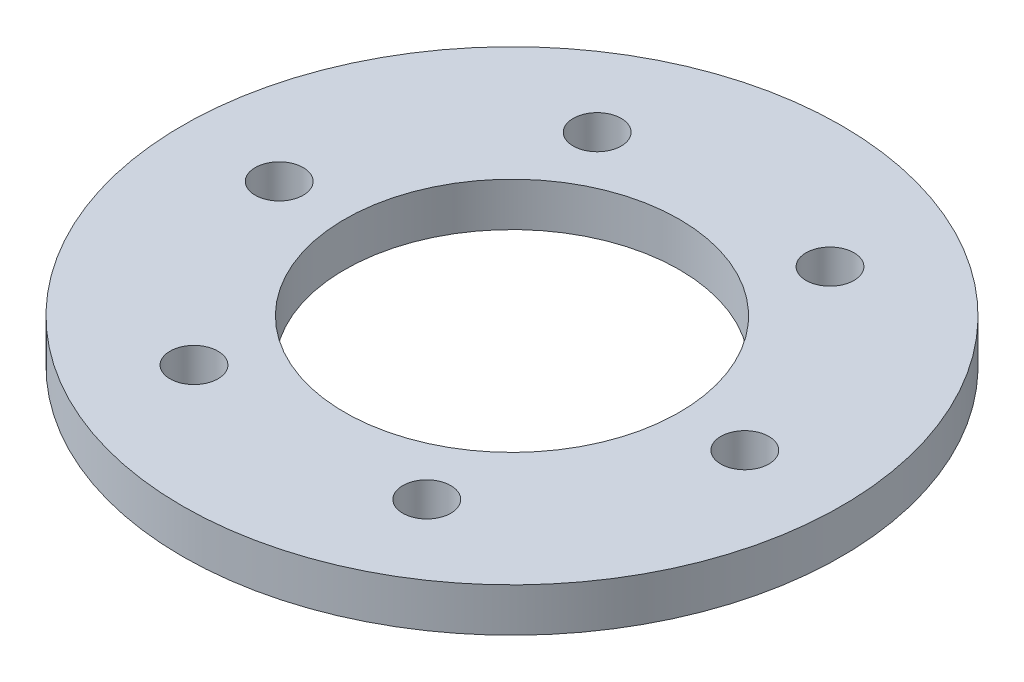
ISO-10303-21;
HEADER;
FILE_DESCRIPTION(('STEP AP214'),'2;1');
FILE_NAME('part.step','',(''),(''),'','','');
FILE_SCHEMA(('AUTOMOTIVE_DESIGN { 1 0 10303 214 1 1 1 1 }'));
ENDSEC;
DATA;
#1=APPLICATION_CONTEXT('core data for automotive mechanical design processes');
#2=APPLICATION_PROTOCOL_DEFINITION('international standard','automotive_design',2000,#1);
#3=PRODUCT_CONTEXT('',#1,'mechanical');
#4=PRODUCT('Part','Part','',(#3));
#5=PRODUCT_RELATED_PRODUCT_CATEGORY('part','',(#4));
#6=PRODUCT_DEFINITION_FORMATION('','',#4);
#7=PRODUCT_DEFINITION_CONTEXT('part definition',#1,'design');
#8=PRODUCT_DEFINITION('design','',#6,#7);
#9=PRODUCT_DEFINITION_SHAPE('','',#8);
#10=(LENGTH_UNIT() NAMED_UNIT(*) SI_UNIT(.MILLI.,.METRE.));
#11=(NAMED_UNIT(*) PLANE_ANGLE_UNIT() SI_UNIT($,.RADIAN.));
#12=(NAMED_UNIT(*) SI_UNIT($,.STERADIAN.) SOLID_ANGLE_UNIT());
#13=UNCERTAINTY_MEASURE_WITH_UNIT(LENGTH_MEASURE(1.E-05),#10,'distance_accuracy_value','');
#14=(GEOMETRIC_REPRESENTATION_CONTEXT(3) GLOBAL_UNCERTAINTY_ASSIGNED_CONTEXT((#13)) GLOBAL_UNIT_ASSIGNED_CONTEXT((#10,
#11,#12)) REPRESENTATION_CONTEXT('',''));
#15=CARTESIAN_POINT('',(0.,0.,0.));
#16=DIRECTION('',(0.,0.,1.));
#17=DIRECTION('',(1.,0.,0.));
#18=AXIS2_PLACEMENT_3D('',#15,#16,#17);
#19=CARTESIAN_POINT('',(-285.501924726853,0.,12.7228753496177));
#20=DIRECTION('',(0.,-1.,0.));
#21=DIRECTION('',(0.,0.,-1.));
#22=AXIS2_PLACEMENT_3D('',#19,#20,#21);
#23=PLANE('',#22);
#24=CARTESIAN_POINT('',(-285.501924726853,0.,12.7228753496177));
#25=DIRECTION('',(0.,-1.,0.));
#26=DIRECTION('',(0.,0.,-1.));
#27=AXIS2_PLACEMENT_3D('',#24,#25,#26);
#28=CIRCLE('',#27,22.65);
#29=CARTESIAN_POINT('',(-285.501924726853,0.,-9.9271246503823));
#30=VERTEX_POINT('',#29);
#31=EDGE_CURVE('E12',#30,#30,#28,.T.);
#32=ORIENTED_EDGE('',*,*,#31,.F.);
#33=EDGE_LOOP('',(#32));
#34=FACE_BOUND('',#33,.T.);
#35=CARTESIAN_POINT('',(-277.501924726853,0.,26.5792818101687));
#36=DIRECTION('',(0.,-1.,0.));
#37=DIRECTION('',(0.,0.,-1.));
#38=AXIS2_PLACEMENT_3D('',#35,#36,#37);
#39=CIRCLE('',#38,1.65);
#40=CARTESIAN_POINT('',(-277.501924726853,0.,24.9292818101687));
#41=VERTEX_POINT('',#40);
#42=EDGE_CURVE('E137',#41,#41,#39,.T.);
#43=ORIENTED_EDGE('',*,*,#42,.T.);
#44=EDGE_LOOP('',(#43));
#45=FACE_BOUND('',#44,.T.);
#46=CARTESIAN_POINT('',(-269.501924726853,0.,12.7228753496177));
#47=DIRECTION('',(0.,-1.,0.));
#48=DIRECTION('',(0.,0.,-1.));
#49=AXIS2_PLACEMENT_3D('',#46,#47,#48);
#50=CIRCLE('',#49,1.65);
#51=CARTESIAN_POINT('',(-269.501924726853,0.,11.0728753496177));
#52=VERTEX_POINT('',#51);
#53=EDGE_CURVE('E108',#52,#52,#50,.T.);
#54=ORIENTED_EDGE('',*,*,#53,.T.);
#55=EDGE_LOOP('',(#54));
#56=FACE_BOUND('',#55,.T.);
#57=CARTESIAN_POINT('',(-277.501924726853,0.,-1.13353111093332));
#58=DIRECTION('',(0.,-1.,0.));
#59=DIRECTION('',(0.,0.,-1.));
#60=AXIS2_PLACEMENT_3D('',#57,#58,#59);
#61=CIRCLE('',#60,1.65);
#62=CARTESIAN_POINT('',(-277.501924726853,0.,-2.78353111093332));
#63=VERTEX_POINT('',#62);
#64=EDGE_CURVE('E23',#63,#63,#61,.T.);
#65=ORIENTED_EDGE('',*,*,#64,.T.);
#66=EDGE_LOOP('',(#65));
#67=FACE_BOUND('',#66,.T.);
#68=CARTESIAN_POINT('',(-293.501924726853,0.,-1.13353111093334));
#69=DIRECTION('',(0.,-1.,0.));
#70=DIRECTION('',(0.,0.,-1.));
#71=AXIS2_PLACEMENT_3D('',#68,#69,#70);
#72=CIRCLE('',#71,1.65);
#73=CARTESIAN_POINT('',(-293.501924726853,0.,-2.78353111093334));
#74=VERTEX_POINT('',#73);
#75=EDGE_CURVE('E133',#74,#74,#72,.T.);
#76=ORIENTED_EDGE('',*,*,#75,.T.);
#77=EDGE_LOOP('',(#76));
#78=FACE_BOUND('',#77,.T.);
#79=CARTESIAN_POINT('',(-301.501924726853,0.,12.7228753496177));
#80=DIRECTION('',(0.,-1.,0.));
#81=DIRECTION('',(0.,0.,-1.));
#82=AXIS2_PLACEMENT_3D('',#79,#80,#81);
#83=CIRCLE('',#82,1.65);
#84=CARTESIAN_POINT('',(-301.501924726853,0.,11.0728753496177));
#85=VERTEX_POINT('',#84);
#86=EDGE_CURVE('E151',#85,#85,#83,.T.);
#87=ORIENTED_EDGE('',*,*,#86,.T.);
#88=EDGE_LOOP('',(#87));
#89=FACE_BOUND('',#88,.T.);
#90=CARTESIAN_POINT('',(-293.501924726853,0.,26.5792818101687));
#91=DIRECTION('',(0.,-1.,0.));
#92=DIRECTION('',(0.,0.,-1.));
#93=AXIS2_PLACEMENT_3D('',#90,#91,#92);
#94=CIRCLE('',#93,1.65);
#95=CARTESIAN_POINT('',(-293.501924726853,0.,24.9292818101687));
#96=VERTEX_POINT('',#95);
#97=EDGE_CURVE('E161',#96,#96,#94,.T.);
#98=ORIENTED_EDGE('',*,*,#97,.T.);
#99=EDGE_LOOP('',(#98));
#100=FACE_BOUND('',#99,.T.);
#101=CARTESIAN_POINT('',(-285.501924726853,0.,12.7228753496177));
#102=DIRECTION('',(0.,-1.,0.));
#103=DIRECTION('',(0.,0.,-1.));
#104=AXIS2_PLACEMENT_3D('',#101,#102,#103);
#105=CIRCLE('',#104,11.5);
#106=CARTESIAN_POINT('',(-285.501924726853,0.,1.2228753496177));
#107=VERTEX_POINT('',#106);
#108=EDGE_CURVE('E148',#107,#107,#105,.T.);
#109=ORIENTED_EDGE('',*,*,#108,.T.);
#110=EDGE_LOOP('',(#109));
#111=FACE_BOUND('',#110,.T.);
#112=ADVANCED_FACE('F19',(#34,#45,#56,#67,#78,#89,#100,#111),#23,.F.);
#113=CARTESIAN_POINT('',(-285.501924726853,-3.,12.7228753496177));
#114=DIRECTION('',(0.,-1.,0.));
#115=DIRECTION('',(0.,0.,-1.));
#116=AXIS2_PLACEMENT_3D('',#113,#114,#115);
#117=PLANE('',#116);
#118=CARTESIAN_POINT('',(-285.501924726853,-3.,12.7228753496177));
#119=DIRECTION('',(0.,-1.,0.));
#120=DIRECTION('',(0.,0.,-1.));
#121=AXIS2_PLACEMENT_3D('',#118,#119,#120);
#122=CIRCLE('',#121,22.65);
#123=CARTESIAN_POINT('',(-285.501924726853,-3.,-9.9271246503823));
#124=VERTEX_POINT('',#123);
#125=EDGE_CURVE('E31',#124,#124,#122,.T.);
#126=ORIENTED_EDGE('',*,*,#125,.T.);
#127=EDGE_LOOP('',(#126));
#128=FACE_BOUND('',#127,.T.);
#129=CARTESIAN_POINT('',(-277.501924726853,-3.,26.5792818101687));
#130=DIRECTION('',(0.,-1.,0.));
#131=DIRECTION('',(0.,0.,-1.));
#132=AXIS2_PLACEMENT_3D('',#129,#130,#131);
#133=CIRCLE('',#132,1.65);
#134=CARTESIAN_POINT('',(-277.501924726853,-3.,24.9292818101687));
#135=VERTEX_POINT('',#134);
#136=EDGE_CURVE('E140',#135,#135,#133,.T.);
#137=ORIENTED_EDGE('',*,*,#136,.F.);
#138=EDGE_LOOP('',(#137));
#139=FACE_BOUND('',#138,.T.);
#140=CARTESIAN_POINT('',(-269.501924726853,-3.,12.7228753496177));
#141=DIRECTION('',(0.,-1.,0.));
#142=DIRECTION('',(0.,0.,-1.));
#143=AXIS2_PLACEMENT_3D('',#140,#141,#142);
#144=CIRCLE('',#143,1.65);
#145=CARTESIAN_POINT('',(-269.501924726853,-3.,11.0728753496177));
#146=VERTEX_POINT('',#145);
#147=EDGE_CURVE('E116',#146,#146,#144,.T.);
#148=ORIENTED_EDGE('',*,*,#147,.F.);
#149=EDGE_LOOP('',(#148));
#150=FACE_BOUND('',#149,.T.);
#151=CARTESIAN_POINT('',(-277.501924726853,-3.,-1.13353111093332));
#152=DIRECTION('',(0.,-1.,0.));
#153=DIRECTION('',(0.,0.,-1.));
#154=AXIS2_PLACEMENT_3D('',#151,#152,#153);
#155=CIRCLE('',#154,1.65);
#156=CARTESIAN_POINT('',(-277.501924726853,-3.,-2.78353111093332));
#157=VERTEX_POINT('',#156);
#158=EDGE_CURVE('E104',#157,#157,#155,.T.);
#159=ORIENTED_EDGE('',*,*,#158,.F.);
#160=EDGE_LOOP('',(#159));
#161=FACE_BOUND('',#160,.T.);
#162=CARTESIAN_POINT('',(-293.501924726853,-3.,-1.13353111093334));
#163=DIRECTION('',(0.,-1.,0.));
#164=DIRECTION('',(0.,0.,-1.));
#165=AXIS2_PLACEMENT_3D('',#162,#163,#164);
#166=CIRCLE('',#165,1.65);
#167=CARTESIAN_POINT('',(-293.501924726853,-3.,-2.78353111093334));
#168=VERTEX_POINT('',#167);
#169=EDGE_CURVE('E114',#168,#168,#166,.T.);
#170=ORIENTED_EDGE('',*,*,#169,.F.);
#171=EDGE_LOOP('',(#170));
#172=FACE_BOUND('',#171,.T.);
#173=CARTESIAN_POINT('',(-301.501924726853,-3.,12.7228753496177));
#174=DIRECTION('',(0.,-1.,0.));
#175=DIRECTION('',(0.,0.,-1.));
#176=AXIS2_PLACEMENT_3D('',#173,#174,#175);
#177=CIRCLE('',#176,1.65);
#178=CARTESIAN_POINT('',(-301.501924726853,-3.,11.0728753496177));
#179=VERTEX_POINT('',#178);
#180=EDGE_CURVE('E122',#179,#179,#177,.T.);
#181=ORIENTED_EDGE('',*,*,#180,.F.);
#182=EDGE_LOOP('',(#181));
#183=FACE_BOUND('',#182,.T.);
#184=CARTESIAN_POINT('',(-293.501924726853,-3.,26.5792818101687));
#185=DIRECTION('',(0.,-1.,0.));
#186=DIRECTION('',(0.,0.,-1.));
#187=AXIS2_PLACEMENT_3D('',#184,#185,#186);
#188=CIRCLE('',#187,1.65);
#189=CARTESIAN_POINT('',(-293.501924726853,-3.,24.9292818101687));
#190=VERTEX_POINT('',#189);
#191=EDGE_CURVE('E154',#190,#190,#188,.T.);
#192=ORIENTED_EDGE('',*,*,#191,.F.);
#193=EDGE_LOOP('',(#192));
#194=FACE_BOUND('',#193,.T.);
#195=CARTESIAN_POINT('',(-285.501924726853,-3.,12.7228753496177));
#196=DIRECTION('',(0.,-1.,0.));
#197=DIRECTION('',(0.,0.,-1.));
#198=AXIS2_PLACEMENT_3D('',#195,#196,#197);
#199=CIRCLE('',#198,11.5);
#200=CARTESIAN_POINT('',(-285.501924726853,-3.,1.2228753496177));
#201=VERTEX_POINT('',#200);
#202=EDGE_CURVE('E134',#201,#201,#199,.T.);
#203=ORIENTED_EDGE('',*,*,#202,.F.);
#204=EDGE_LOOP('',(#203));
#205=FACE_BOUND('',#204,.T.);
#206=ADVANCED_FACE('F181',(#128,#139,#150,#161,#172,#183,#194,#205),#117,.T.);
#207=CARTESIAN_POINT('',(-285.501924726853,-3.,12.7228753496177));
#208=DIRECTION('',(0.,1.,0.));
#209=DIRECTION('',(0.,0.,1.));
#210=AXIS2_PLACEMENT_3D('',#207,#208,#209);
#211=CYLINDRICAL_SURFACE('',#210,22.65);
#212=ORIENTED_EDGE('',*,*,#31,.T.);
#213=EDGE_LOOP('',(#212));
#214=FACE_BOUND('',#213,.T.);
#215=ORIENTED_EDGE('',*,*,#125,.F.);
#216=EDGE_LOOP('',(#215));
#217=FACE_BOUND('',#216,.T.);
#218=ADVANCED_FACE('F184',(#214,#217),#211,.T.);
#219=CARTESIAN_POINT('',(-285.501924726853,-3.,12.7228753496177));
#220=DIRECTION('',(0.,1.,0.));
#221=DIRECTION('',(0.,0.,1.));
#222=AXIS2_PLACEMENT_3D('',#219,#220,#221);
#223=CYLINDRICAL_SURFACE('',#222,11.5);
#224=ORIENTED_EDGE('',*,*,#108,.F.);
#225=EDGE_LOOP('',(#224));
#226=FACE_BOUND('',#225,.T.);
#227=ORIENTED_EDGE('',*,*,#202,.T.);
#228=EDGE_LOOP('',(#227));
#229=FACE_BOUND('',#228,.T.);
#230=ADVANCED_FACE('F198',(#226,#229),#223,.F.);
#231=CARTESIAN_POINT('',(-293.501924726853,-3.,26.5792818101687));
#232=DIRECTION('',(0.,1.,0.));
#233=DIRECTION('',(0.,0.,1.));
#234=AXIS2_PLACEMENT_3D('',#231,#232,#233);
#235=CYLINDRICAL_SURFACE('',#234,1.65);
#236=ORIENTED_EDGE('',*,*,#97,.F.);
#237=EDGE_LOOP('',(#236));
#238=FACE_BOUND('',#237,.T.);
#239=ORIENTED_EDGE('',*,*,#191,.T.);
#240=EDGE_LOOP('',(#239));
#241=FACE_BOUND('',#240,.T.);
#242=ADVANCED_FACE('F200',(#238,#241),#235,.F.);
#243=CARTESIAN_POINT('',(-301.501924726853,-3.,12.7228753496177));
#244=DIRECTION('',(0.,1.,0.));
#245=DIRECTION('',(0.,0.,1.));
#246=AXIS2_PLACEMENT_3D('',#243,#244,#245);
#247=CYLINDRICAL_SURFACE('',#246,1.65);
#248=ORIENTED_EDGE('',*,*,#86,.F.);
#249=EDGE_LOOP('',(#248));
#250=FACE_BOUND('',#249,.T.);
#251=ORIENTED_EDGE('',*,*,#180,.T.);
#252=EDGE_LOOP('',(#251));
#253=FACE_BOUND('',#252,.T.);
#254=ADVANCED_FACE('F21',(#250,#253),#247,.F.);
#255=CARTESIAN_POINT('',(-293.501924726853,-3.,-1.13353111093334));
#256=DIRECTION('',(0.,1.,0.));
#257=DIRECTION('',(0.,0.,1.));
#258=AXIS2_PLACEMENT_3D('',#255,#256,#257);
#259=CYLINDRICAL_SURFACE('',#258,1.65);
#260=ORIENTED_EDGE('',*,*,#75,.F.);
#261=EDGE_LOOP('',(#260));
#262=FACE_BOUND('',#261,.T.);
#263=ORIENTED_EDGE('',*,*,#169,.T.);
#264=EDGE_LOOP('',(#263));
#265=FACE_BOUND('',#264,.T.);
#266=ADVANCED_FACE('F223',(#262,#265),#259,.F.);
#267=CARTESIAN_POINT('',(-277.501924726853,-3.,-1.13353111093332));
#268=DIRECTION('',(0.,1.,0.));
#269=DIRECTION('',(0.,0.,1.));
#270=AXIS2_PLACEMENT_3D('',#267,#268,#269);
#271=CYLINDRICAL_SURFACE('',#270,1.65);
#272=ORIENTED_EDGE('',*,*,#64,.F.);
#273=EDGE_LOOP('',(#272));
#274=FACE_BOUND('',#273,.T.);
#275=ORIENTED_EDGE('',*,*,#158,.T.);
#276=EDGE_LOOP('',(#275));
#277=FACE_BOUND('',#276,.T.);
#278=ADVANCED_FACE('F105',(#274,#277),#271,.F.);
#279=CARTESIAN_POINT('',(-269.501924726853,-3.,12.7228753496177));
#280=DIRECTION('',(0.,1.,0.));
#281=DIRECTION('',(0.,0.,1.));
#282=AXIS2_PLACEMENT_3D('',#279,#280,#281);
#283=CYLINDRICAL_SURFACE('',#282,1.65);
#284=ORIENTED_EDGE('',*,*,#53,.F.);
#285=EDGE_LOOP('',(#284));
#286=FACE_BOUND('',#285,.T.);
#287=ORIENTED_EDGE('',*,*,#147,.T.);
#288=EDGE_LOOP('',(#287));
#289=FACE_BOUND('',#288,.T.);
#290=ADVANCED_FACE('F218',(#286,#289),#283,.F.);
#291=CARTESIAN_POINT('',(-277.501924726853,-3.,26.5792818101687));
#292=DIRECTION('',(0.,1.,0.));
#293=DIRECTION('',(0.,0.,1.));
#294=AXIS2_PLACEMENT_3D('',#291,#292,#293);
#295=CYLINDRICAL_SURFACE('',#294,1.65);
#296=ORIENTED_EDGE('',*,*,#42,.F.);
#297=EDGE_LOOP('',(#296));
#298=FACE_BOUND('',#297,.T.);
#299=ORIENTED_EDGE('',*,*,#136,.T.);
#300=EDGE_LOOP('',(#299));
#301=FACE_BOUND('',#300,.T.);
#302=ADVANCED_FACE('F220',(#298,#301),#295,.F.);
#303=CLOSED_SHELL('',(#112,#206,#218,#230,#242,#254,#266,#278,#290,#302));
#304=MANIFOLD_SOLID_BREP('B1',#303);
#305=ADVANCED_BREP_SHAPE_REPRESENTATION('',(#18,#304),#14);
#306=SHAPE_DEFINITION_REPRESENTATION(#9,#305);
ENDSEC;
END-ISO-10303-21;
